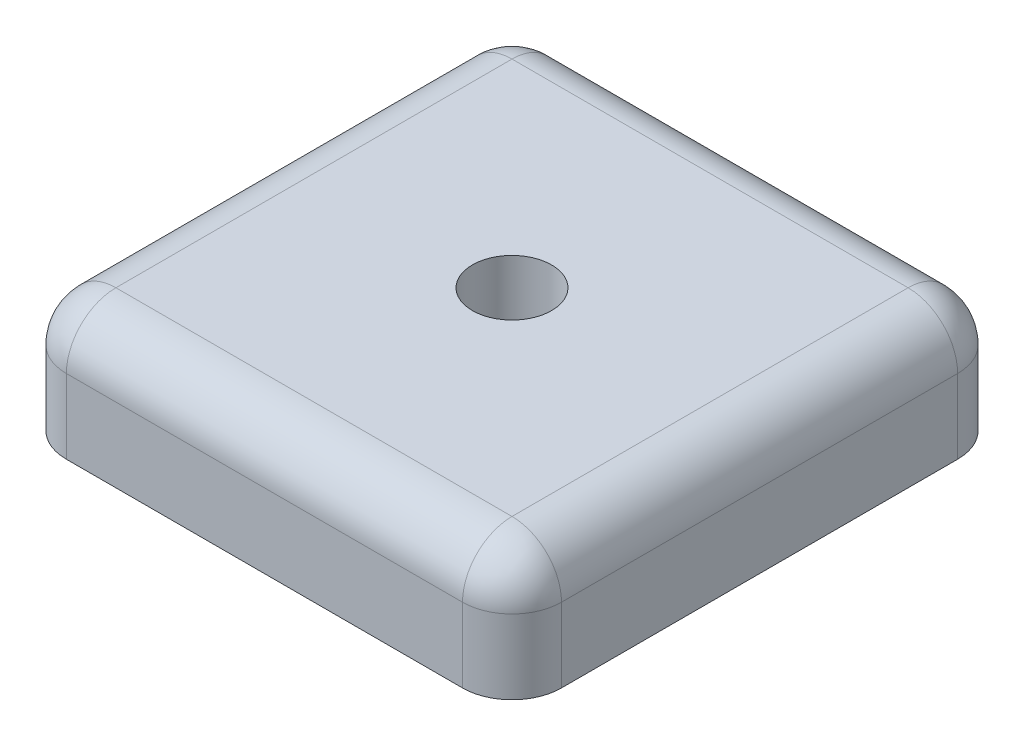
ISO-10303-21;
HEADER;
FILE_DESCRIPTION(('STEP AP214'),'2;1');
FILE_NAME('part.step','',(''),(''),'','','');
FILE_SCHEMA(('AUTOMOTIVE_DESIGN { 1 0 10303 214 1 1 1 1 }'));
ENDSEC;
DATA;
#1=APPLICATION_CONTEXT('core data for automotive mechanical design processes');
#2=APPLICATION_PROTOCOL_DEFINITION('international standard','automotive_design',2000,#1);
#3=PRODUCT_CONTEXT('',#1,'mechanical');
#4=PRODUCT('Part','Part','',(#3));
#5=PRODUCT_RELATED_PRODUCT_CATEGORY('part','',(#4));
#6=PRODUCT_DEFINITION_FORMATION('','',#4);
#7=PRODUCT_DEFINITION_CONTEXT('part definition',#1,'design');
#8=PRODUCT_DEFINITION('design','',#6,#7);
#9=PRODUCT_DEFINITION_SHAPE('','',#8);
#10=(LENGTH_UNIT() NAMED_UNIT(*) SI_UNIT(.MILLI.,.METRE.));
#11=(NAMED_UNIT(*) PLANE_ANGLE_UNIT() SI_UNIT($,.RADIAN.));
#12=(NAMED_UNIT(*) SI_UNIT($,.STERADIAN.) SOLID_ANGLE_UNIT());
#13=UNCERTAINTY_MEASURE_WITH_UNIT(LENGTH_MEASURE(1.E-05),#10,'distance_accuracy_value','');
#14=(GEOMETRIC_REPRESENTATION_CONTEXT(3) GLOBAL_UNCERTAINTY_ASSIGNED_CONTEXT((#13)) GLOBAL_UNIT_ASSIGNED_CONTEXT((#10,
#11,#12)) REPRESENTATION_CONTEXT('',''));
#15=CARTESIAN_POINT('',(0.,0.,0.));
#16=DIRECTION('',(0.,0.,1.));
#17=DIRECTION('',(1.,0.,0.));
#18=AXIS2_PLACEMENT_3D('',#15,#16,#17);
#19=CARTESIAN_POINT('',(0.,5.,0.));
#20=DIRECTION('',(0.,0.,-1.));
#21=DIRECTION('',(-1.,0.,0.));
#22=AXIS2_PLACEMENT_3D('',#19,#20,#21);
#23=PLANE('',#22);
#24=DIRECTION('',(1.,0.,0.));
#25=VECTOR('',#24,1.);
#26=CARTESIAN_POINT('',(0.,0.,0.));
#27=LINE('',#26,#25);
#28=CARTESIAN_POINT('',(2.,0.,0.));
#29=VERTEX_POINT('',#28);
#30=CARTESIAN_POINT('',(18.,0.,0.));
#31=VERTEX_POINT('',#30);
#32=EDGE_CURVE('E117',#29,#31,#27,.T.);
#33=ORIENTED_EDGE('',*,*,#32,.T.);
#34=DIRECTION('',(0.,-1.,0.));
#35=VECTOR('',#34,1.);
#36=CARTESIAN_POINT('',(18.,5.,0.));
#37=LINE('',#36,#35);
#38=CARTESIAN_POINT('',(18.,3.,0.));
#39=VERTEX_POINT('',#38);
#40=EDGE_CURVE('E162',#31,#39,#37,.F.);
#41=ORIENTED_EDGE('',*,*,#40,.T.);
#42=DIRECTION('',(1.,0.,0.));
#43=VECTOR('',#42,1.);
#44=CARTESIAN_POINT('',(0.,3.,0.));
#45=LINE('',#44,#43);
#46=CARTESIAN_POINT('',(2.,3.,0.));
#47=VERTEX_POINT('',#46);
#48=EDGE_CURVE('E158',#39,#47,#45,.F.);
#49=ORIENTED_EDGE('',*,*,#48,.T.);
#50=DIRECTION('',(0.,-1.,0.));
#51=VECTOR('',#50,1.);
#52=CARTESIAN_POINT('',(2.,0.,0.));
#53=LINE('',#52,#51);
#54=EDGE_CURVE('E160',#47,#29,#53,.T.);
#55=ORIENTED_EDGE('',*,*,#54,.T.);
#56=EDGE_LOOP('',(#33,#41,#49,#55));
#57=FACE_BOUND('',#56,.T.);
#58=ADVANCED_FACE('F35',(#57),#23,.F.);
#59=CARTESIAN_POINT('',(20.,5.,0.));
#60=DIRECTION('',(-1.,0.,0.));
#61=DIRECTION('',(0.,0.,1.));
#62=AXIS2_PLACEMENT_3D('',#59,#60,#61);
#63=PLANE('',#62);
#64=DIRECTION('',(0.,0.,-1.));
#65=VECTOR('',#64,1.);
#66=CARTESIAN_POINT('',(20.,0.,0.));
#67=LINE('',#66,#65);
#68=CARTESIAN_POINT('',(20.,0.,-2.));
#69=VERTEX_POINT('',#68);
#70=CARTESIAN_POINT('',(20.,0.,-18.));
#71=VERTEX_POINT('',#70);
#72=EDGE_CURVE('E212',#69,#71,#67,.T.);
#73=ORIENTED_EDGE('',*,*,#72,.T.);
#74=DIRECTION('',(0.,-1.,0.));
#75=VECTOR('',#74,1.);
#76=CARTESIAN_POINT('',(20.,5.,-18.));
#77=LINE('',#76,#75);
#78=CARTESIAN_POINT('',(20.,3.,-18.));
#79=VERTEX_POINT('',#78);
#80=EDGE_CURVE('E156',#71,#79,#77,.F.);
#81=ORIENTED_EDGE('',*,*,#80,.T.);
#82=DIRECTION('',(0.,0.,-1.));
#83=VECTOR('',#82,1.);
#84=CARTESIAN_POINT('',(20.,3.,0.));
#85=LINE('',#84,#83);
#86=CARTESIAN_POINT('',(20.,3.,-2.));
#87=VERTEX_POINT('',#86);
#88=EDGE_CURVE('E152',#79,#87,#85,.F.);
#89=ORIENTED_EDGE('',*,*,#88,.T.);
#90=DIRECTION('',(0.,-1.,0.));
#91=VECTOR('',#90,1.);
#92=CARTESIAN_POINT('',(20.,5.,-2.));
#93=LINE('',#92,#91);
#94=EDGE_CURVE('E154',#87,#69,#93,.T.);
#95=ORIENTED_EDGE('',*,*,#94,.T.);
#96=EDGE_LOOP('',(#73,#81,#89,#95));
#97=FACE_BOUND('',#96,.T.);
#98=ADVANCED_FACE('F227',(#97),#63,.F.);
#99=CARTESIAN_POINT('',(0.,5.,-20.));
#100=DIRECTION('',(0.,0.,-1.));
#101=DIRECTION('',(-1.,0.,0.));
#102=AXIS2_PLACEMENT_3D('',#99,#100,#101);
#103=PLANE('',#102);
#104=DIRECTION('',(1.,0.,0.));
#105=VECTOR('',#104,1.);
#106=CARTESIAN_POINT('',(0.,0.,-20.));
#107=LINE('',#106,#105);
#108=CARTESIAN_POINT('',(2.,0.,-20.));
#109=VERTEX_POINT('',#108);
#110=CARTESIAN_POINT('',(18.,0.,-20.));
#111=VERTEX_POINT('',#110);
#112=EDGE_CURVE('E131',#109,#111,#107,.T.);
#113=ORIENTED_EDGE('',*,*,#112,.F.);
#114=DIRECTION('',(0.,-1.,0.));
#115=VECTOR('',#114,1.);
#116=CARTESIAN_POINT('',(2.,5.,-20.));
#117=LINE('',#116,#115);
#118=CARTESIAN_POINT('',(2.,3.,-20.));
#119=VERTEX_POINT('',#118);
#120=EDGE_CURVE('E150',#109,#119,#117,.F.);
#121=ORIENTED_EDGE('',*,*,#120,.T.);
#122=DIRECTION('',(1.,0.,0.));
#123=VECTOR('',#122,1.);
#124=CARTESIAN_POINT('',(0.,3.,-20.));
#125=LINE('',#124,#123);
#126=CARTESIAN_POINT('',(18.,3.,-20.));
#127=VERTEX_POINT('',#126);
#128=EDGE_CURVE('E146',#119,#127,#125,.T.);
#129=ORIENTED_EDGE('',*,*,#128,.T.);
#130=DIRECTION('',(0.,-1.,0.));
#131=VECTOR('',#130,1.);
#132=CARTESIAN_POINT('',(18.,0.,-20.));
#133=LINE('',#132,#131);
#134=EDGE_CURVE('E148',#127,#111,#133,.T.);
#135=ORIENTED_EDGE('',*,*,#134,.T.);
#136=EDGE_LOOP('',(#113,#121,#129,#135));
#137=FACE_BOUND('',#136,.T.);
#138=ADVANCED_FACE('F268',(#137),#103,.T.);
#139=CARTESIAN_POINT('',(0.,5.,0.));
#140=DIRECTION('',(-1.,0.,0.));
#141=DIRECTION('',(0.,0.,1.));
#142=AXIS2_PLACEMENT_3D('',#139,#140,#141);
#143=PLANE('',#142);
#144=DIRECTION('',(0.,0.,-1.));
#145=VECTOR('',#144,1.);
#146=CARTESIAN_POINT('',(0.,3.,0.));
#147=LINE('',#146,#145);
#148=CARTESIAN_POINT('',(0.,3.,-2.));
#149=VERTEX_POINT('',#148);
#150=CARTESIAN_POINT('',(0.,3.,-18.));
#151=VERTEX_POINT('',#150);
#152=EDGE_CURVE('E130',#149,#151,#147,.T.);
#153=ORIENTED_EDGE('',*,*,#152,.T.);
#154=DIRECTION('',(0.,-1.,0.));
#155=VECTOR('',#154,1.);
#156=CARTESIAN_POINT('',(0.,5.,-18.));
#157=LINE('',#156,#155);
#158=CARTESIAN_POINT('',(0.,0.,-18.));
#159=VERTEX_POINT('',#158);
#160=EDGE_CURVE('E122',#151,#159,#157,.T.);
#161=ORIENTED_EDGE('',*,*,#160,.T.);
#162=DIRECTION('',(0.,0.,-1.));
#163=VECTOR('',#162,1.);
#164=CARTESIAN_POINT('',(0.,0.,0.));
#165=LINE('',#164,#163);
#166=CARTESIAN_POINT('',(0.,0.,-2.));
#167=VERTEX_POINT('',#166);
#168=EDGE_CURVE('E115',#167,#159,#165,.T.);
#169=ORIENTED_EDGE('',*,*,#168,.F.);
#170=DIRECTION('',(0.,-1.,0.));
#171=VECTOR('',#170,1.);
#172=CARTESIAN_POINT('',(0.,5.,-2.));
#173=LINE('',#172,#171);
#174=EDGE_CURVE('E127',#167,#149,#173,.F.);
#175=ORIENTED_EDGE('',*,*,#174,.T.);
#176=EDGE_LOOP('',(#153,#161,#169,#175));
#177=FACE_BOUND('',#176,.T.);
#178=ADVANCED_FACE('F126',(#177),#143,.T.);
#179=CARTESIAN_POINT('',(0.,5.,0.));
#180=DIRECTION('',(0.,1.,0.));
#181=DIRECTION('',(0.,0.,1.));
#182=AXIS2_PLACEMENT_3D('',#179,#180,#181);
#183=PLANE('',#182);
#184=DIRECTION('',(0.,0.,-1.));
#185=VECTOR('',#184,1.);
#186=CARTESIAN_POINT('',(2.,5.,0.));
#187=LINE('',#186,#185);
#188=CARTESIAN_POINT('',(2.,5.,-18.));
#189=VERTEX_POINT('',#188);
#190=CARTESIAN_POINT('',(2.,5.,-2.));
#191=VERTEX_POINT('',#190);
#192=EDGE_CURVE('E164',#189,#191,#187,.F.);
#193=ORIENTED_EDGE('',*,*,#192,.T.);
#194=DIRECTION('',(1.,0.,0.));
#195=VECTOR('',#194,1.);
#196=CARTESIAN_POINT('',(20.,5.,-2.));
#197=LINE('',#196,#195);
#198=CARTESIAN_POINT('',(18.,5.,-2.));
#199=VERTEX_POINT('',#198);
#200=EDGE_CURVE('E11',#191,#199,#197,.T.);
#201=ORIENTED_EDGE('',*,*,#200,.T.);
#202=DIRECTION('',(0.,0.,-1.));
#203=VECTOR('',#202,1.);
#204=CARTESIAN_POINT('',(18.,5.,-20.));
#205=LINE('',#204,#203);
#206=CARTESIAN_POINT('',(18.,5.,-18.));
#207=VERTEX_POINT('',#206);
#208=EDGE_CURVE('E44',#199,#207,#205,.T.);
#209=ORIENTED_EDGE('',*,*,#208,.T.);
#210=DIRECTION('',(1.,0.,0.));
#211=VECTOR('',#210,1.);
#212=CARTESIAN_POINT('',(0.,5.,-18.));
#213=LINE('',#212,#211);
#214=EDGE_CURVE('E166',#207,#189,#213,.F.);
#215=ORIENTED_EDGE('',*,*,#214,.T.);
#216=EDGE_LOOP('',(#193,#201,#209,#215));
#217=FACE_BOUND('',#216,.T.);
#218=CARTESIAN_POINT('',(10.,5.,-10.));
#219=DIRECTION('',(0.,1.,0.));
#220=DIRECTION('',(0.,0.,1.));
#221=AXIS2_PLACEMENT_3D('',#218,#219,#220);
#222=CIRCLE('',#221,1.6);
#223=CARTESIAN_POINT('',(10.,5.,-8.4));
#224=VERTEX_POINT('',#223);
#225=EDGE_CURVE('E199',#224,#224,#222,.T.);
#226=ORIENTED_EDGE('',*,*,#225,.F.);
#227=EDGE_LOOP('',(#226));
#228=FACE_BOUND('',#227,.T.);
#229=ADVANCED_FACE('F239',(#217,#228),#183,.T.);
#230=CARTESIAN_POINT('',(0.,0.,0.));
#231=DIRECTION('',(0.,1.,0.));
#232=DIRECTION('',(0.,0.,1.));
#233=AXIS2_PLACEMENT_3D('',#230,#231,#232);
#234=PLANE('',#233);
#235=CARTESIAN_POINT('',(10.,0.,-10.));
#236=DIRECTION('',(0.,1.,0.));
#237=DIRECTION('',(0.,0.,1.));
#238=AXIS2_PLACEMENT_3D('',#235,#236,#237);
#239=CIRCLE('',#238,1.6);
#240=CARTESIAN_POINT('',(10.,0.,-8.4));
#241=VERTEX_POINT('',#240);
#242=EDGE_CURVE('E204',#241,#241,#239,.T.);
#243=ORIENTED_EDGE('',*,*,#242,.T.);
#244=EDGE_LOOP('',(#243));
#245=FACE_BOUND('',#244,.T.);
#246=ORIENTED_EDGE('',*,*,#168,.T.);
#247=CARTESIAN_POINT('',(2.,0.,-18.));
#248=DIRECTION('',(0.,1.,0.));
#249=DIRECTION('',(0.,0.,1.));
#250=AXIS2_PLACEMENT_3D('',#247,#248,#249);
#251=CIRCLE('',#250,2.);
#252=EDGE_CURVE('E144',#159,#109,#251,.F.);
#253=ORIENTED_EDGE('',*,*,#252,.T.);
#254=ORIENTED_EDGE('',*,*,#112,.T.);
#255=CARTESIAN_POINT('',(18.,0.,-18.));
#256=DIRECTION('',(0.,1.,0.));
#257=DIRECTION('',(0.,0.,1.));
#258=AXIS2_PLACEMENT_3D('',#255,#256,#257);
#259=CIRCLE('',#258,2.);
#260=EDGE_CURVE('E142',#111,#71,#259,.F.);
#261=ORIENTED_EDGE('',*,*,#260,.T.);
#262=ORIENTED_EDGE('',*,*,#72,.F.);
#263=CARTESIAN_POINT('',(18.,0.,-2.));
#264=DIRECTION('',(0.,1.,0.));
#265=DIRECTION('',(0.,0.,1.));
#266=AXIS2_PLACEMENT_3D('',#263,#264,#265);
#267=CIRCLE('',#266,2.);
#268=EDGE_CURVE('E121',#69,#31,#267,.F.);
#269=ORIENTED_EDGE('',*,*,#268,.T.);
#270=ORIENTED_EDGE('',*,*,#32,.F.);
#271=CARTESIAN_POINT('',(2.,0.,-2.));
#272=DIRECTION('',(0.,1.,0.));
#273=DIRECTION('',(0.,0.,1.));
#274=AXIS2_PLACEMENT_3D('',#271,#272,#273);
#275=CIRCLE('',#274,2.);
#276=EDGE_CURVE('E112',#29,#167,#275,.F.);
#277=ORIENTED_EDGE('',*,*,#276,.T.);
#278=EDGE_LOOP('',(#246,#253,#254,#261,#262,#269,#270,#277));
#279=FACE_BOUND('',#278,.T.);
#280=ADVANCED_FACE('F114',(#245,#279),#234,.F.);
#281=CARTESIAN_POINT('',(10.,0.,-10.));
#282=DIRECTION('',(0.,1.,0.));
#283=DIRECTION('',(0.,0.,1.));
#284=AXIS2_PLACEMENT_3D('',#281,#282,#283);
#285=CYLINDRICAL_SURFACE('',#284,1.6);
#286=ORIENTED_EDGE('',*,*,#242,.F.);
#287=EDGE_LOOP('',(#286));
#288=FACE_BOUND('',#287,.T.);
#289=ORIENTED_EDGE('',*,*,#225,.T.);
#290=EDGE_LOOP('',(#289));
#291=FACE_BOUND('',#290,.T.);
#292=ADVANCED_FACE('F260',(#288,#291),#285,.F.);
#293=CARTESIAN_POINT('',(18.,5.,-2.));
#294=DIRECTION('',(0.,-1.,0.));
#295=DIRECTION('',(0.,0.,-1.));
#296=AXIS2_PLACEMENT_3D('',#293,#294,#295);
#297=CYLINDRICAL_SURFACE('',#296,2.);
#298=CARTESIAN_POINT('',(18.,3.,-2.));
#299=DIRECTION('',(0.,1.,0.));
#300=DIRECTION('',(0.,0.,1.));
#301=AXIS2_PLACEMENT_3D('',#298,#299,#300);
#302=CIRCLE('',#301,2.);
#303=EDGE_CURVE('E39',#39,#87,#302,.T.);
#304=ORIENTED_EDGE('',*,*,#303,.F.);
#305=ORIENTED_EDGE('',*,*,#40,.F.);
#306=ORIENTED_EDGE('',*,*,#268,.F.);
#307=ORIENTED_EDGE('',*,*,#94,.F.);
#308=EDGE_LOOP('',(#304,#305,#306,#307));
#309=FACE_BOUND('',#308,.T.);
#310=ADVANCED_FACE('F37',(#309),#297,.T.);
#311=CARTESIAN_POINT('',(18.,3.,-2.));
#312=DIRECTION('',(1.,0.,0.));
#313=DIRECTION('',(0.,0.,-1.));
#314=AXIS2_PLACEMENT_3D('',#311,#312,#313);
#315=SPHERICAL_SURFACE('',#314,2.);
#316=CARTESIAN_POINT('',(18.,3.,-2.));
#317=DIRECTION('',(1.,0.,0.));
#318=DIRECTION('',(0.,0.,-1.));
#319=AXIS2_PLACEMENT_3D('',#316,#317,#318);
#320=CIRCLE('',#319,2.);
#321=EDGE_CURVE('E194',#39,#199,#320,.F.);
#322=ORIENTED_EDGE('',*,*,#321,.F.);
#323=ORIENTED_EDGE('',*,*,#303,.T.);
#324=CARTESIAN_POINT('',(18.,3.,-2.));
#325=DIRECTION('',(0.,0.,1.));
#326=DIRECTION('',(1.,0.,0.));
#327=AXIS2_PLACEMENT_3D('',#324,#325,#326);
#328=CIRCLE('',#327,2.);
#329=EDGE_CURVE('E196',#199,#87,#328,.F.);
#330=ORIENTED_EDGE('',*,*,#329,.F.);
#331=EDGE_LOOP('',(#322,#323,#330));
#332=FACE_BOUND('',#331,.T.);
#333=ADVANCED_FACE('F253',(#332),#315,.T.);
#334=CARTESIAN_POINT('',(18.,5.,-18.));
#335=DIRECTION('',(0.,1.,0.));
#336=DIRECTION('',(0.,0.,1.));
#337=AXIS2_PLACEMENT_3D('',#334,#335,#336);
#338=CYLINDRICAL_SURFACE('',#337,2.);
#339=ORIENTED_EDGE('',*,*,#260,.F.);
#340=ORIENTED_EDGE('',*,*,#134,.F.);
#341=CARTESIAN_POINT('',(18.,3.,-18.));
#342=DIRECTION('',(0.,1.,0.));
#343=DIRECTION('',(0.,0.,1.));
#344=AXIS2_PLACEMENT_3D('',#341,#342,#343);
#345=CIRCLE('',#344,2.);
#346=EDGE_CURVE('E191',#79,#127,#345,.T.);
#347=ORIENTED_EDGE('',*,*,#346,.F.);
#348=ORIENTED_EDGE('',*,*,#80,.F.);
#349=EDGE_LOOP('',(#339,#340,#347,#348));
#350=FACE_BOUND('',#349,.T.);
#351=ADVANCED_FACE('F224',(#350),#338,.T.);
#352=CARTESIAN_POINT('',(18.,3.,0.));
#353=DIRECTION('',(0.,0.,1.));
#354=DIRECTION('',(1.,0.,0.));
#355=AXIS2_PLACEMENT_3D('',#352,#353,#354);
#356=CYLINDRICAL_SURFACE('',#355,2.);
#357=ORIENTED_EDGE('',*,*,#329,.T.);
#358=ORIENTED_EDGE('',*,*,#88,.F.);
#359=CARTESIAN_POINT('',(18.,3.,-18.));
#360=DIRECTION('',(0.,0.,-1.));
#361=DIRECTION('',(-1.,0.,0.));
#362=AXIS2_PLACEMENT_3D('',#359,#360,#361);
#363=CIRCLE('',#362,2.);
#364=EDGE_CURVE('E188',#207,#79,#363,.T.);
#365=ORIENTED_EDGE('',*,*,#364,.F.);
#366=ORIENTED_EDGE('',*,*,#208,.F.);
#367=EDGE_LOOP('',(#357,#358,#365,#366));
#368=FACE_BOUND('',#367,.T.);
#369=ADVANCED_FACE('F229',(#368),#356,.T.);
#370=CARTESIAN_POINT('',(0.,3.,-2.));
#371=DIRECTION('',(-1.,0.,0.));
#372=DIRECTION('',(0.,0.,1.));
#373=AXIS2_PLACEMENT_3D('',#370,#371,#372);
#374=CYLINDRICAL_SURFACE('',#373,2.);
#375=ORIENTED_EDGE('',*,*,#321,.T.);
#376=ORIENTED_EDGE('',*,*,#200,.F.);
#377=CARTESIAN_POINT('',(2.,3.,-2.));
#378=DIRECTION('',(-1.,0.,0.));
#379=DIRECTION('',(0.,0.,1.));
#380=AXIS2_PLACEMENT_3D('',#377,#378,#379);
#381=CIRCLE('',#380,2.);
#382=EDGE_CURVE('E185',#47,#191,#381,.T.);
#383=ORIENTED_EDGE('',*,*,#382,.F.);
#384=ORIENTED_EDGE('',*,*,#48,.F.);
#385=EDGE_LOOP('',(#375,#376,#383,#384));
#386=FACE_BOUND('',#385,.T.);
#387=ADVANCED_FACE('F252',(#386),#374,.T.);
#388=CARTESIAN_POINT('',(2.,5.,-2.));
#389=DIRECTION('',(0.,1.,0.));
#390=DIRECTION('',(0.,0.,1.));
#391=AXIS2_PLACEMENT_3D('',#388,#389,#390);
#392=CYLINDRICAL_SURFACE('',#391,2.);
#393=ORIENTED_EDGE('',*,*,#276,.F.);
#394=ORIENTED_EDGE('',*,*,#54,.F.);
#395=CARTESIAN_POINT('',(2.,3.,-2.));
#396=DIRECTION('',(0.,1.,0.));
#397=DIRECTION('',(0.,0.,1.));
#398=AXIS2_PLACEMENT_3D('',#395,#396,#397);
#399=CIRCLE('',#398,2.);
#400=EDGE_CURVE('E135',#149,#47,#399,.T.);
#401=ORIENTED_EDGE('',*,*,#400,.F.);
#402=ORIENTED_EDGE('',*,*,#174,.F.);
#403=EDGE_LOOP('',(#393,#394,#401,#402));
#404=FACE_BOUND('',#403,.T.);
#405=ADVANCED_FACE('F133',(#404),#392,.T.);
#406=CARTESIAN_POINT('',(18.,3.,-18.));
#407=DIRECTION('',(1.,0.,0.));
#408=DIRECTION('',(0.,0.,-1.));
#409=AXIS2_PLACEMENT_3D('',#406,#407,#408);
#410=SPHERICAL_SURFACE('',#409,2.);
#411=ORIENTED_EDGE('',*,*,#364,.T.);
#412=ORIENTED_EDGE('',*,*,#346,.T.);
#413=CARTESIAN_POINT('',(18.,3.,-18.));
#414=DIRECTION('',(1.,0.,0.));
#415=DIRECTION('',(0.,0.,-1.));
#416=AXIS2_PLACEMENT_3D('',#413,#414,#415);
#417=CIRCLE('',#416,2.);
#418=EDGE_CURVE('E181',#207,#127,#417,.F.);
#419=ORIENTED_EDGE('',*,*,#418,.F.);
#420=EDGE_LOOP('',(#411,#412,#419));
#421=FACE_BOUND('',#420,.T.);
#422=ADVANCED_FACE('F233',(#421),#410,.T.);
#423=CARTESIAN_POINT('',(2.,3.,-2.));
#424=DIRECTION('',(0.,0.,1.));
#425=DIRECTION('',(1.,0.,0.));
#426=AXIS2_PLACEMENT_3D('',#423,#424,#425);
#427=SPHERICAL_SURFACE('',#426,2.);
#428=ORIENTED_EDGE('',*,*,#400,.T.);
#429=ORIENTED_EDGE('',*,*,#382,.T.);
#430=CARTESIAN_POINT('',(2.,3.,-2.));
#431=DIRECTION('',(0.,0.,1.));
#432=DIRECTION('',(1.,0.,0.));
#433=AXIS2_PLACEMENT_3D('',#430,#431,#432);
#434=CIRCLE('',#433,2.);
#435=EDGE_CURVE('E178',#149,#191,#434,.F.);
#436=ORIENTED_EDGE('',*,*,#435,.F.);
#437=EDGE_LOOP('',(#428,#429,#436));
#438=FACE_BOUND('',#437,.T.);
#439=ADVANCED_FACE('F248',(#438),#427,.T.);
#440=CARTESIAN_POINT('',(0.,3.,-18.));
#441=DIRECTION('',(1.,0.,0.));
#442=DIRECTION('',(0.,0.,-1.));
#443=AXIS2_PLACEMENT_3D('',#440,#441,#442);
#444=CYLINDRICAL_SURFACE('',#443,2.);
#445=ORIENTED_EDGE('',*,*,#418,.T.);
#446=ORIENTED_EDGE('',*,*,#128,.F.);
#447=CARTESIAN_POINT('',(2.,3.,-18.));
#448=DIRECTION('',(-1.,0.,0.));
#449=DIRECTION('',(0.,0.,1.));
#450=AXIS2_PLACEMENT_3D('',#447,#448,#449);
#451=CIRCLE('',#450,2.);
#452=EDGE_CURVE('E175',#189,#119,#451,.T.);
#453=ORIENTED_EDGE('',*,*,#452,.F.);
#454=ORIENTED_EDGE('',*,*,#214,.F.);
#455=EDGE_LOOP('',(#445,#446,#453,#454));
#456=FACE_BOUND('',#455,.T.);
#457=ADVANCED_FACE('F237',(#456),#444,.T.);
#458=CARTESIAN_POINT('',(2.,3.,0.));
#459=DIRECTION('',(0.,0.,-1.));
#460=DIRECTION('',(-1.,0.,0.));
#461=AXIS2_PLACEMENT_3D('',#458,#459,#460);
#462=CYLINDRICAL_SURFACE('',#461,2.);
#463=ORIENTED_EDGE('',*,*,#435,.T.);
#464=ORIENTED_EDGE('',*,*,#192,.F.);
#465=CARTESIAN_POINT('',(2.,3.,-18.));
#466=DIRECTION('',(0.,0.,-1.));
#467=DIRECTION('',(-1.,0.,0.));
#468=AXIS2_PLACEMENT_3D('',#465,#466,#467);
#469=CIRCLE('',#468,2.);
#470=EDGE_CURVE('E172',#151,#189,#469,.T.);
#471=ORIENTED_EDGE('',*,*,#470,.F.);
#472=ORIENTED_EDGE('',*,*,#152,.F.);
#473=EDGE_LOOP('',(#463,#464,#471,#472));
#474=FACE_BOUND('',#473,.T.);
#475=ADVANCED_FACE('F244',(#474),#462,.T.);
#476=CARTESIAN_POINT('',(2.,3.,-18.));
#477=DIRECTION('',(0.,1.,0.));
#478=DIRECTION('',(0.,0.,1.));
#479=AXIS2_PLACEMENT_3D('',#476,#477,#478);
#480=SPHERICAL_SURFACE('',#479,2.);
#481=ORIENTED_EDGE('',*,*,#470,.T.);
#482=ORIENTED_EDGE('',*,*,#452,.T.);
#483=CARTESIAN_POINT('',(2.,3.,-18.));
#484=DIRECTION('',(0.,1.,0.));
#485=DIRECTION('',(0.,0.,1.));
#486=AXIS2_PLACEMENT_3D('',#483,#484,#485);
#487=CIRCLE('',#486,2.);
#488=EDGE_CURVE('E169',#151,#119,#487,.F.);
#489=ORIENTED_EDGE('',*,*,#488,.F.);
#490=EDGE_LOOP('',(#481,#482,#489));
#491=FACE_BOUND('',#490,.T.);
#492=ADVANCED_FACE('F275',(#491),#480,.T.);
#493=CARTESIAN_POINT('',(2.,5.,-18.));
#494=DIRECTION('',(0.,-1.,0.));
#495=DIRECTION('',(0.,0.,-1.));
#496=AXIS2_PLACEMENT_3D('',#493,#494,#495);
#497=CYLINDRICAL_SURFACE('',#496,2.);
#498=ORIENTED_EDGE('',*,*,#488,.T.);
#499=ORIENTED_EDGE('',*,*,#120,.F.);
#500=ORIENTED_EDGE('',*,*,#252,.F.);
#501=ORIENTED_EDGE('',*,*,#160,.F.);
#502=EDGE_LOOP('',(#498,#499,#500,#501));
#503=FACE_BOUND('',#502,.T.);
#504=ADVANCED_FACE('F272',(#503),#497,.T.);
#505=CLOSED_SHELL('',(#58,#98,#138,#178,#229,#280,#292,#310,#333,#351,#369,#387,#405,#422,#439,
#457,#475,#492,#504));
#506=MANIFOLD_SOLID_BREP('B2',#505);
#507=ADVANCED_BREP_SHAPE_REPRESENTATION('',(#18,#506),#14);
#508=SHAPE_DEFINITION_REPRESENTATION(#9,#507);
ENDSEC;
END-ISO-10303-21;
